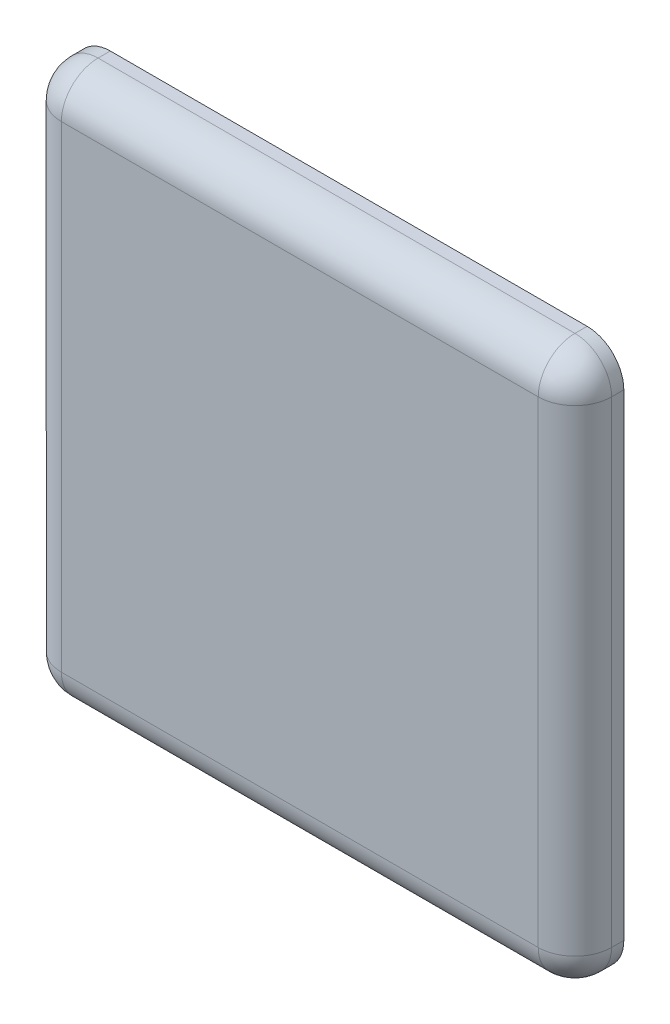
ISO-10303-21;
HEADER;
FILE_DESCRIPTION(('STEP AP214'),'2;1');
FILE_NAME('part.step','',(''),(''),'','','');
FILE_SCHEMA(('AUTOMOTIVE_DESIGN { 1 0 10303 214 1 1 1 1 }'));
ENDSEC;
DATA;
#1=APPLICATION_CONTEXT('core data for automotive mechanical design processes');
#2=APPLICATION_PROTOCOL_DEFINITION('international standard','automotive_design',2000,#1);
#3=PRODUCT_CONTEXT('',#1,'mechanical');
#4=PRODUCT('Part','Part','',(#3));
#5=PRODUCT_RELATED_PRODUCT_CATEGORY('part','',(#4));
#6=PRODUCT_DEFINITION_FORMATION('','',#4);
#7=PRODUCT_DEFINITION_CONTEXT('part definition',#1,'design');
#8=PRODUCT_DEFINITION('design','',#6,#7);
#9=PRODUCT_DEFINITION_SHAPE('','',#8);
#10=(LENGTH_UNIT() NAMED_UNIT(*) SI_UNIT(.MILLI.,.METRE.));
#11=(NAMED_UNIT(*) PLANE_ANGLE_UNIT() SI_UNIT($,.RADIAN.));
#12=(NAMED_UNIT(*) SI_UNIT($,.STERADIAN.) SOLID_ANGLE_UNIT());
#13=UNCERTAINTY_MEASURE_WITH_UNIT(LENGTH_MEASURE(1.E-05),#10,'distance_accuracy_value','');
#14=(GEOMETRIC_REPRESENTATION_CONTEXT(3) GLOBAL_UNCERTAINTY_ASSIGNED_CONTEXT((#13)) GLOBAL_UNIT_ASSIGNED_CONTEXT((#10,
#11,#12)) REPRESENTATION_CONTEXT('',''));
#15=CARTESIAN_POINT('',(0.,0.,0.));
#16=DIRECTION('',(0.,0.,1.));
#17=DIRECTION('',(1.,0.,0.));
#18=AXIS2_PLACEMENT_3D('',#15,#16,#17);
#19=CARTESIAN_POINT('',(0.,0.,4.));
#20=DIRECTION('',(0.,0.,1.));
#21=DIRECTION('',(1.,0.,0.));
#22=AXIS2_PLACEMENT_3D('',#19,#20,#21);
#23=PLANE('',#22);
#24=DIRECTION('',(1.,0.,0.));
#25=VECTOR('',#24,1.);
#26=CARTESIAN_POINT('',(-39.08016580655,-19.5,4.));
#27=LINE('',#26,#25);
#28=CARTESIAN_POINT('',(19.5,-19.5,4.));
#29=VERTEX_POINT('',#28);
#30=CARTESIAN_POINT('',(-19.5,-19.5,4.));
#31=VERTEX_POINT('',#30);
#32=EDGE_CURVE('E72',#29,#31,#27,.F.);
#33=ORIENTED_EDGE('',*,*,#32,.F.);
#34=DIRECTION('',(0.,1.,0.));
#35=VECTOR('',#34,1.);
#36=CARTESIAN_POINT('',(19.5,-39.08016580655,4.));
#37=LINE('',#36,#35);
#38=CARTESIAN_POINT('',(19.5,19.5,4.));
#39=VERTEX_POINT('',#38);
#40=EDGE_CURVE('E68',#39,#29,#37,.F.);
#41=ORIENTED_EDGE('',*,*,#40,.F.);
#42=DIRECTION('',(-1.,0.,0.));
#43=VECTOR('',#42,1.);
#44=CARTESIAN_POINT('',(39.08016580655,19.5,4.));
#45=LINE('',#44,#43);
#46=CARTESIAN_POINT('',(-19.5,19.5,4.));
#47=VERTEX_POINT('',#46);
#48=EDGE_CURVE('E56',#47,#39,#45,.F.);
#49=ORIENTED_EDGE('',*,*,#48,.F.);
#50=DIRECTION('',(0.,-1.,0.));
#51=VECTOR('',#50,1.);
#52=CARTESIAN_POINT('',(-19.5,39.08016580655,4.));
#53=LINE('',#52,#51);
#54=EDGE_CURVE('E144',#31,#47,#53,.F.);
#55=ORIENTED_EDGE('',*,*,#54,.F.);
#56=EDGE_LOOP('',(#33,#41,#49,#55));
#57=FACE_BOUND('',#56,.T.);
#58=ADVANCED_FACE('F15',(#57),#23,.T.);
#59=CARTESIAN_POINT('',(19.5,19.5,1.));
#60=DIRECTION('',(0.707106781186548,0.,0.707106781186548));
#61=DIRECTION('',(0.,1.,0.));
#62=AXIS2_PLACEMENT_3D('',#59,#60,#61);
#63=SPHERICAL_SURFACE('',#62,3.);
#64=CARTESIAN_POINT('',(19.5,19.5,1.));
#65=DIRECTION('',(0.,1.,0.));
#66=DIRECTION('',(0.,0.,1.));
#67=AXIS2_PLACEMENT_3D('',#64,#65,#66);
#68=CIRCLE('',#67,3.);
#69=CARTESIAN_POINT('',(22.5,19.5,1.));
#70=VERTEX_POINT('',#69);
#71=CARTESIAN_POINT('',(21.6213203435596,19.5,3.12132034355964));
#72=VERTEX_POINT('',#71);
#73=EDGE_CURVE('E85',#70,#72,#68,.F.);
#74=ORIENTED_EDGE('',*,*,#73,.F.);
#75=CARTESIAN_POINT('',(19.5,19.5,1.));
#76=DIRECTION('',(0.,0.,-1.));
#77=DIRECTION('',(-1.,0.,0.));
#78=AXIS2_PLACEMENT_3D('',#75,#76,#77);
#79=CIRCLE('',#78,3.);
#80=CARTESIAN_POINT('',(19.5,22.5,1.));
#81=VERTEX_POINT('',#80);
#82=EDGE_CURVE('E76',#81,#70,#79,.T.);
#83=ORIENTED_EDGE('',*,*,#82,.F.);
#84=CARTESIAN_POINT('',(19.5,19.5,1.));
#85=DIRECTION('',(-1.,0.,0.));
#86=DIRECTION('',(0.,0.,1.));
#87=AXIS2_PLACEMENT_3D('',#84,#85,#86);
#88=CIRCLE('',#87,3.);
#89=EDGE_CURVE('E19',#39,#81,#88,.T.);
#90=ORIENTED_EDGE('',*,*,#89,.F.);
#91=CARTESIAN_POINT('',(19.5,19.5,1.));
#92=DIRECTION('',(0.,1.,0.));
#93=DIRECTION('',(0.,0.,1.));
#94=AXIS2_PLACEMENT_3D('',#91,#92,#93);
#95=CIRCLE('',#94,3.);
#96=EDGE_CURVE('E77',#72,#39,#95,.F.);
#97=ORIENTED_EDGE('',*,*,#96,.F.);
#98=EDGE_LOOP('',(#74,#83,#90,#97));
#99=FACE_BOUND('',#98,.T.);
#100=ADVANCED_FACE('F88',(#99),#63,.T.);
#101=CARTESIAN_POINT('',(39.08016580655,19.5,1.));
#102=DIRECTION('',(-1.,0.,0.));
#103=DIRECTION('',(0.,0.,1.));
#104=AXIS2_PLACEMENT_3D('',#101,#102,#103);
#105=CYLINDRICAL_SURFACE('',#104,3.);
#106=CARTESIAN_POINT('',(-19.5,19.5,1.));
#107=DIRECTION('',(-1.,0.,0.));
#108=DIRECTION('',(0.,0.,1.));
#109=AXIS2_PLACEMENT_3D('',#106,#107,#108);
#110=CIRCLE('',#109,3.);
#111=CARTESIAN_POINT('',(-19.5,22.5,1.));
#112=VERTEX_POINT('',#111);
#113=EDGE_CURVE('E62',#47,#112,#110,.T.);
#114=ORIENTED_EDGE('',*,*,#113,.F.);
#115=ORIENTED_EDGE('',*,*,#48,.T.);
#116=ORIENTED_EDGE('',*,*,#89,.T.);
#117=DIRECTION('',(1.,0.,0.));
#118=VECTOR('',#117,1.);
#119=CARTESIAN_POINT('',(22.5,22.5,1.));
#120=LINE('',#119,#118);
#121=EDGE_CURVE('E101',#112,#81,#120,.T.);
#122=ORIENTED_EDGE('',*,*,#121,.F.);
#123=EDGE_LOOP('',(#114,#115,#116,#122));
#124=FACE_BOUND('',#123,.T.);
#125=ADVANCED_FACE('F58',(#124),#105,.T.);
#126=CARTESIAN_POINT('',(-19.5,19.5,1.));
#127=DIRECTION('',(-0.707106781186548,0.,0.707106781186548));
#128=DIRECTION('',(0.,1.,0.));
#129=AXIS2_PLACEMENT_3D('',#126,#127,#128);
#130=SPHERICAL_SURFACE('',#129,3.);
#131=ORIENTED_EDGE('',*,*,#113,.T.);
#132=CARTESIAN_POINT('',(-19.5,19.5,1.));
#133=DIRECTION('',(0.,0.,-1.));
#134=DIRECTION('',(-1.,0.,0.));
#135=AXIS2_PLACEMENT_3D('',#132,#133,#134);
#136=CIRCLE('',#135,3.);
#137=CARTESIAN_POINT('',(-22.5,19.5,1.));
#138=VERTEX_POINT('',#137);
#139=EDGE_CURVE('E108',#138,#112,#136,.T.);
#140=ORIENTED_EDGE('',*,*,#139,.F.);
#141=CARTESIAN_POINT('',(-19.5,19.5,1.));
#142=DIRECTION('',(0.,-1.,0.));
#143=DIRECTION('',(0.,0.,-1.));
#144=AXIS2_PLACEMENT_3D('',#141,#142,#143);
#145=CIRCLE('',#144,3.);
#146=CARTESIAN_POINT('',(-21.6213203435596,19.5,3.12132034355964));
#147=VERTEX_POINT('',#146);
#148=EDGE_CURVE('E141',#147,#138,#145,.T.);
#149=ORIENTED_EDGE('',*,*,#148,.F.);
#150=CARTESIAN_POINT('',(-19.5,19.5,1.));
#151=DIRECTION('',(0.,-1.,0.));
#152=DIRECTION('',(0.,0.,-1.));
#153=AXIS2_PLACEMENT_3D('',#150,#151,#152);
#154=CIRCLE('',#153,3.);
#155=EDGE_CURVE('E34',#47,#147,#154,.T.);
#156=ORIENTED_EDGE('',*,*,#155,.F.);
#157=EDGE_LOOP('',(#131,#140,#149,#156));
#158=FACE_BOUND('',#157,.T.);
#159=ADVANCED_FACE('F176',(#158),#130,.T.);
#160=CARTESIAN_POINT('',(-19.5,39.08016580655,1.));
#161=DIRECTION('',(0.,-1.,0.));
#162=DIRECTION('',(0.,0.,-1.));
#163=AXIS2_PLACEMENT_3D('',#160,#161,#162);
#164=CYLINDRICAL_SURFACE('',#163,3.);
#165=CARTESIAN_POINT('',(-19.5,-19.5,1.));
#166=DIRECTION('',(0.,-1.,0.));
#167=DIRECTION('',(0.,0.,-1.));
#168=AXIS2_PLACEMENT_3D('',#165,#166,#167);
#169=CIRCLE('',#168,3.);
#170=CARTESIAN_POINT('',(-22.5,-19.5,1.));
#171=VERTEX_POINT('',#170);
#172=EDGE_CURVE('E135',#31,#171,#169,.T.);
#173=ORIENTED_EDGE('',*,*,#172,.F.);
#174=ORIENTED_EDGE('',*,*,#54,.T.);
#175=ORIENTED_EDGE('',*,*,#155,.T.);
#176=ORIENTED_EDGE('',*,*,#148,.T.);
#177=DIRECTION('',(0.,1.,0.));
#178=VECTOR('',#177,1.);
#179=CARTESIAN_POINT('',(-22.5,22.5,1.));
#180=LINE('',#179,#178);
#181=EDGE_CURVE('E136',#171,#138,#180,.T.);
#182=ORIENTED_EDGE('',*,*,#181,.F.);
#183=EDGE_LOOP('',(#173,#174,#175,#176,#182));
#184=FACE_BOUND('',#183,.T.);
#185=ADVANCED_FACE('F286',(#184),#164,.T.);
#186=CARTESIAN_POINT('',(-19.5,-19.5,1.));
#187=DIRECTION('',(0.,-0.707106781186548,0.707106781186548));
#188=DIRECTION('',(-1.,0.,0.));
#189=AXIS2_PLACEMENT_3D('',#186,#187,#188);
#190=SPHERICAL_SURFACE('',#189,3.);
#191=ORIENTED_EDGE('',*,*,#172,.T.);
#192=CARTESIAN_POINT('',(-19.5,-19.5,1.));
#193=DIRECTION('',(0.,0.,-1.));
#194=DIRECTION('',(-1.,0.,0.));
#195=AXIS2_PLACEMENT_3D('',#192,#193,#194);
#196=CIRCLE('',#195,3.);
#197=CARTESIAN_POINT('',(-19.5,-22.5,1.));
#198=VERTEX_POINT('',#197);
#199=EDGE_CURVE('E139',#198,#171,#196,.T.);
#200=ORIENTED_EDGE('',*,*,#199,.F.);
#201=CARTESIAN_POINT('',(-19.5,-19.5,1.));
#202=DIRECTION('',(1.,0.,0.));
#203=DIRECTION('',(0.,0.,-1.));
#204=AXIS2_PLACEMENT_3D('',#201,#202,#203);
#205=CIRCLE('',#204,3.);
#206=CARTESIAN_POINT('',(-19.5,-21.6213203435596,3.12132034355964));
#207=VERTEX_POINT('',#206);
#208=EDGE_CURVE('E134',#207,#198,#205,.T.);
#209=ORIENTED_EDGE('',*,*,#208,.F.);
#210=CARTESIAN_POINT('',(-19.5,-19.5,1.));
#211=DIRECTION('',(1.,0.,0.));
#212=DIRECTION('',(0.,0.,-1.));
#213=AXIS2_PLACEMENT_3D('',#210,#211,#212);
#214=CIRCLE('',#213,3.);
#215=EDGE_CURVE('E132',#31,#207,#214,.T.);
#216=ORIENTED_EDGE('',*,*,#215,.F.);
#217=EDGE_LOOP('',(#191,#200,#209,#216));
#218=FACE_BOUND('',#217,.T.);
#219=ADVANCED_FACE('F287',(#218),#190,.T.);
#220=CARTESIAN_POINT('',(-39.08016580655,-19.5,1.));
#221=DIRECTION('',(1.,0.,0.));
#222=DIRECTION('',(0.,0.,-1.));
#223=AXIS2_PLACEMENT_3D('',#220,#221,#222);
#224=CYLINDRICAL_SURFACE('',#223,3.);
#225=CARTESIAN_POINT('',(19.5,-19.5,1.));
#226=DIRECTION('',(1.,0.,0.));
#227=DIRECTION('',(0.,0.,-1.));
#228=AXIS2_PLACEMENT_3D('',#225,#226,#227);
#229=CIRCLE('',#228,3.);
#230=CARTESIAN_POINT('',(19.5,-22.5,1.));
#231=VERTEX_POINT('',#230);
#232=EDGE_CURVE('E126',#29,#231,#229,.T.);
#233=ORIENTED_EDGE('',*,*,#232,.F.);
#234=ORIENTED_EDGE('',*,*,#32,.T.);
#235=ORIENTED_EDGE('',*,*,#215,.T.);
#236=ORIENTED_EDGE('',*,*,#208,.T.);
#237=DIRECTION('',(1.,0.,0.));
#238=VECTOR('',#237,1.);
#239=CARTESIAN_POINT('',(-22.5,-22.5,1.));
#240=LINE('',#239,#238);
#241=EDGE_CURVE('E127',#231,#198,#240,.F.);
#242=ORIENTED_EDGE('',*,*,#241,.F.);
#243=EDGE_LOOP('',(#233,#234,#235,#236,#242));
#244=FACE_BOUND('',#243,.T.);
#245=ADVANCED_FACE('F211',(#244),#224,.T.);
#246=CARTESIAN_POINT('',(19.5,-19.5,1.));
#247=DIRECTION('',(0.707106781186548,0.,0.707106781186548));
#248=DIRECTION('',(0.,-1.,0.));
#249=AXIS2_PLACEMENT_3D('',#246,#247,#248);
#250=SPHERICAL_SURFACE('',#249,3.);
#251=ORIENTED_EDGE('',*,*,#232,.T.);
#252=CARTESIAN_POINT('',(19.5,-19.5,1.));
#253=DIRECTION('',(0.,0.,-1.));
#254=DIRECTION('',(-1.,0.,0.));
#255=AXIS2_PLACEMENT_3D('',#252,#253,#254);
#256=CIRCLE('',#255,3.);
#257=CARTESIAN_POINT('',(22.5,-19.5,1.));
#258=VERTEX_POINT('',#257);
#259=EDGE_CURVE('E130',#258,#231,#256,.T.);
#260=ORIENTED_EDGE('',*,*,#259,.F.);
#261=CARTESIAN_POINT('',(19.5,-19.5,1.));
#262=DIRECTION('',(0.,1.,0.));
#263=DIRECTION('',(0.,0.,1.));
#264=AXIS2_PLACEMENT_3D('',#261,#262,#263);
#265=CIRCLE('',#264,3.);
#266=CARTESIAN_POINT('',(21.6213203435596,-19.5,3.12132034355964));
#267=VERTEX_POINT('',#266);
#268=EDGE_CURVE('E119',#267,#258,#265,.T.);
#269=ORIENTED_EDGE('',*,*,#268,.F.);
#270=CARTESIAN_POINT('',(19.5,-19.5,1.));
#271=DIRECTION('',(0.,1.,0.));
#272=DIRECTION('',(0.,0.,1.));
#273=AXIS2_PLACEMENT_3D('',#270,#271,#272);
#274=CIRCLE('',#273,3.);
#275=EDGE_CURVE('E124',#29,#267,#274,.T.);
#276=ORIENTED_EDGE('',*,*,#275,.F.);
#277=EDGE_LOOP('',(#251,#260,#269,#276));
#278=FACE_BOUND('',#277,.T.);
#279=ADVANCED_FACE('F207',(#278),#250,.T.);
#280=CARTESIAN_POINT('',(19.5,-39.08016580655,1.));
#281=DIRECTION('',(0.,1.,0.));
#282=DIRECTION('',(0.,0.,1.));
#283=AXIS2_PLACEMENT_3D('',#280,#281,#282);
#284=CYLINDRICAL_SURFACE('',#283,3.);
#285=ORIENTED_EDGE('',*,*,#96,.T.);
#286=ORIENTED_EDGE('',*,*,#40,.T.);
#287=ORIENTED_EDGE('',*,*,#275,.T.);
#288=ORIENTED_EDGE('',*,*,#268,.T.);
#289=DIRECTION('',(0.,1.,0.));
#290=VECTOR('',#289,1.);
#291=CARTESIAN_POINT('',(22.5,-22.5,1.));
#292=LINE('',#291,#290);
#293=EDGE_CURVE('E120',#70,#258,#292,.F.);
#294=ORIENTED_EDGE('',*,*,#293,.F.);
#295=ORIENTED_EDGE('',*,*,#73,.T.);
#296=EDGE_LOOP('',(#285,#286,#287,#288,#294,#295));
#297=FACE_BOUND('',#296,.T.);
#298=ADVANCED_FACE('F81',(#297),#284,.T.);
#299=CARTESIAN_POINT('',(19.5,19.5,4.109537206765));
#300=DIRECTION('',(0.,0.,-1.));
#301=DIRECTION('',(-1.,0.,0.));
#302=AXIS2_PLACEMENT_3D('',#299,#300,#301);
#303=CYLINDRICAL_SURFACE('',#302,3.);
#304=CARTESIAN_POINT('',(19.5,19.5,0.));
#305=DIRECTION('',(0.,0.,-1.));
#306=DIRECTION('',(-1.,0.,0.));
#307=AXIS2_PLACEMENT_3D('',#304,#305,#306);
#308=CIRCLE('',#307,3.);
#309=CARTESIAN_POINT('',(22.5,19.5,0.));
#310=VERTEX_POINT('',#309);
#311=CARTESIAN_POINT('',(19.5,22.5,0.));
#312=VERTEX_POINT('',#311);
#313=EDGE_CURVE('E113',#310,#312,#308,.F.);
#314=ORIENTED_EDGE('',*,*,#313,.T.);
#315=DIRECTION('',(0.,0.,1.));
#316=VECTOR('',#315,1.);
#317=CARTESIAN_POINT('',(19.5,22.5,0.));
#318=LINE('',#317,#316);
#319=EDGE_CURVE('E96',#81,#312,#318,.F.);
#320=ORIENTED_EDGE('',*,*,#319,.F.);
#321=ORIENTED_EDGE('',*,*,#82,.T.);
#322=DIRECTION('',(0.,0.,-1.));
#323=VECTOR('',#322,1.);
#324=CARTESIAN_POINT('',(22.5,19.5,0.));
#325=LINE('',#324,#323);
#326=EDGE_CURVE('E123',#310,#70,#325,.F.);
#327=ORIENTED_EDGE('',*,*,#326,.F.);
#328=EDGE_LOOP('',(#314,#320,#321,#327));
#329=FACE_BOUND('',#328,.T.);
#330=ADVANCED_FACE('F111',(#329),#303,.T.);
#331=CARTESIAN_POINT('',(22.5,22.5,0.));
#332=DIRECTION('',(0.,1.,0.));
#333=DIRECTION('',(0.,0.,1.));
#334=AXIS2_PLACEMENT_3D('',#331,#332,#333);
#335=PLANE('',#334);
#336=DIRECTION('',(0.,0.,-1.));
#337=VECTOR('',#336,1.);
#338=CARTESIAN_POINT('',(-19.5,22.5,4.109537206765));
#339=LINE('',#338,#337);
#340=CARTESIAN_POINT('',(-19.5,22.5,0.));
#341=VERTEX_POINT('',#340);
#342=EDGE_CURVE('E107',#112,#341,#339,.T.);
#343=ORIENTED_EDGE('',*,*,#342,.F.);
#344=ORIENTED_EDGE('',*,*,#121,.T.);
#345=ORIENTED_EDGE('',*,*,#319,.T.);
#346=DIRECTION('',(1.,0.,0.));
#347=VECTOR('',#346,1.);
#348=CARTESIAN_POINT('',(0.,22.5,0.));
#349=LINE('',#348,#347);
#350=EDGE_CURVE('E156',#312,#341,#349,.F.);
#351=ORIENTED_EDGE('',*,*,#350,.T.);
#352=EDGE_LOOP('',(#343,#344,#345,#351));
#353=FACE_BOUND('',#352,.T.);
#354=ADVANCED_FACE('F102',(#353),#335,.T.);
#355=CARTESIAN_POINT('',(-19.5,19.5,4.109537206765));
#356=DIRECTION('',(0.,0.,-1.));
#357=DIRECTION('',(-1.,0.,0.));
#358=AXIS2_PLACEMENT_3D('',#355,#356,#357);
#359=CYLINDRICAL_SURFACE('',#358,3.);
#360=CARTESIAN_POINT('',(-19.5,19.5,0.));
#361=DIRECTION('',(0.,0.,-1.));
#362=DIRECTION('',(-1.,0.,0.));
#363=AXIS2_PLACEMENT_3D('',#360,#361,#362);
#364=CIRCLE('',#363,3.);
#365=CARTESIAN_POINT('',(-22.5,19.5,0.));
#366=VERTEX_POINT('',#365);
#367=EDGE_CURVE('E153',#341,#366,#364,.F.);
#368=ORIENTED_EDGE('',*,*,#367,.T.);
#369=DIRECTION('',(0.,0.,1.));
#370=VECTOR('',#369,1.);
#371=CARTESIAN_POINT('',(-22.5,19.5,0.));
#372=LINE('',#371,#370);
#373=EDGE_CURVE('E140',#138,#366,#372,.F.);
#374=ORIENTED_EDGE('',*,*,#373,.F.);
#375=ORIENTED_EDGE('',*,*,#139,.T.);
#376=ORIENTED_EDGE('',*,*,#342,.T.);
#377=EDGE_LOOP('',(#368,#374,#375,#376));
#378=FACE_BOUND('',#377,.T.);
#379=ADVANCED_FACE('F179',(#378),#359,.T.);
#380=CARTESIAN_POINT('',(-22.5,22.5,0.));
#381=DIRECTION('',(-1.,0.,0.));
#382=DIRECTION('',(0.,0.,1.));
#383=AXIS2_PLACEMENT_3D('',#380,#381,#382);
#384=PLANE('',#383);
#385=DIRECTION('',(0.,0.,-1.));
#386=VECTOR('',#385,1.);
#387=CARTESIAN_POINT('',(-22.5,-19.5,4.109537206765));
#388=LINE('',#387,#386);
#389=CARTESIAN_POINT('',(-22.5,-19.5,0.));
#390=VERTEX_POINT('',#389);
#391=EDGE_CURVE('E163',#171,#390,#388,.T.);
#392=ORIENTED_EDGE('',*,*,#391,.F.);
#393=ORIENTED_EDGE('',*,*,#181,.T.);
#394=ORIENTED_EDGE('',*,*,#373,.T.);
#395=DIRECTION('',(0.,1.,0.));
#396=VECTOR('',#395,1.);
#397=CARTESIAN_POINT('',(-22.5,0.,0.));
#398=LINE('',#397,#396);
#399=EDGE_CURVE('E152',#366,#390,#398,.F.);
#400=ORIENTED_EDGE('',*,*,#399,.T.);
#401=EDGE_LOOP('',(#392,#393,#394,#400));
#402=FACE_BOUND('',#401,.T.);
#403=ADVANCED_FACE('F222',(#402),#384,.T.);
#404=CARTESIAN_POINT('',(-19.5,-19.5,4.109537206765));
#405=DIRECTION('',(0.,0.,-1.));
#406=DIRECTION('',(-1.,0.,0.));
#407=AXIS2_PLACEMENT_3D('',#404,#405,#406);
#408=CYLINDRICAL_SURFACE('',#407,3.);
#409=CARTESIAN_POINT('',(-19.5,-19.5,0.));
#410=DIRECTION('',(0.,0.,-1.));
#411=DIRECTION('',(-1.,0.,0.));
#412=AXIS2_PLACEMENT_3D('',#409,#410,#411);
#413=CIRCLE('',#412,3.);
#414=CARTESIAN_POINT('',(-19.5,-22.5,0.));
#415=VERTEX_POINT('',#414);
#416=EDGE_CURVE('E149',#390,#415,#413,.F.);
#417=ORIENTED_EDGE('',*,*,#416,.T.);
#418=DIRECTION('',(0.,0.,-1.));
#419=VECTOR('',#418,1.);
#420=CARTESIAN_POINT('',(-19.5,-22.5,0.));
#421=LINE('',#420,#419);
#422=EDGE_CURVE('E131',#198,#415,#421,.T.);
#423=ORIENTED_EDGE('',*,*,#422,.F.);
#424=ORIENTED_EDGE('',*,*,#199,.T.);
#425=ORIENTED_EDGE('',*,*,#391,.T.);
#426=EDGE_LOOP('',(#417,#423,#424,#425));
#427=FACE_BOUND('',#426,.T.);
#428=ADVANCED_FACE('F225',(#427),#408,.T.);
#429=CARTESIAN_POINT('',(-22.5,-22.5,0.));
#430=DIRECTION('',(0.,-1.,0.));
#431=DIRECTION('',(0.,0.,-1.));
#432=AXIS2_PLACEMENT_3D('',#429,#430,#431);
#433=PLANE('',#432);
#434=DIRECTION('',(0.,0.,-1.));
#435=VECTOR('',#434,1.);
#436=CARTESIAN_POINT('',(19.5,-22.5,4.109537206765));
#437=LINE('',#436,#435);
#438=CARTESIAN_POINT('',(19.5,-22.5,0.));
#439=VERTEX_POINT('',#438);
#440=EDGE_CURVE('E160',#231,#439,#437,.T.);
#441=ORIENTED_EDGE('',*,*,#440,.F.);
#442=ORIENTED_EDGE('',*,*,#241,.T.);
#443=ORIENTED_EDGE('',*,*,#422,.T.);
#444=DIRECTION('',(1.,0.,0.));
#445=VECTOR('',#444,1.);
#446=CARTESIAN_POINT('',(0.,-22.5,0.));
#447=LINE('',#446,#445);
#448=EDGE_CURVE('E148',#415,#439,#447,.T.);
#449=ORIENTED_EDGE('',*,*,#448,.T.);
#450=EDGE_LOOP('',(#441,#442,#443,#449));
#451=FACE_BOUND('',#450,.T.);
#452=ADVANCED_FACE('F228',(#451),#433,.T.);
#453=CARTESIAN_POINT('',(19.5,-19.5,4.109537206765));
#454=DIRECTION('',(0.,0.,-1.));
#455=DIRECTION('',(-1.,0.,0.));
#456=AXIS2_PLACEMENT_3D('',#453,#454,#455);
#457=CYLINDRICAL_SURFACE('',#456,3.);
#458=CARTESIAN_POINT('',(19.5,-19.5,0.));
#459=DIRECTION('',(0.,0.,-1.));
#460=DIRECTION('',(-1.,0.,0.));
#461=AXIS2_PLACEMENT_3D('',#458,#459,#460);
#462=CIRCLE('',#461,3.);
#463=CARTESIAN_POINT('',(22.5,-19.5,0.));
#464=VERTEX_POINT('',#463);
#465=EDGE_CURVE('E25',#439,#464,#462,.F.);
#466=ORIENTED_EDGE('',*,*,#465,.T.);
#467=DIRECTION('',(0.,0.,-1.));
#468=VECTOR('',#467,1.);
#469=CARTESIAN_POINT('',(22.5,-19.5,0.));
#470=LINE('',#469,#468);
#471=EDGE_CURVE('E194',#258,#464,#470,.T.);
#472=ORIENTED_EDGE('',*,*,#471,.F.);
#473=ORIENTED_EDGE('',*,*,#259,.T.);
#474=ORIENTED_EDGE('',*,*,#440,.T.);
#475=EDGE_LOOP('',(#466,#472,#473,#474));
#476=FACE_BOUND('',#475,.T.);
#477=ADVANCED_FACE('F232',(#476),#457,.T.);
#478=CARTESIAN_POINT('',(22.5,-22.5,0.));
#479=DIRECTION('',(1.,0.,0.));
#480=DIRECTION('',(0.,0.,-1.));
#481=AXIS2_PLACEMENT_3D('',#478,#479,#480);
#482=PLANE('',#481);
#483=ORIENTED_EDGE('',*,*,#326,.T.);
#484=ORIENTED_EDGE('',*,*,#293,.T.);
#485=ORIENTED_EDGE('',*,*,#471,.T.);
#486=DIRECTION('',(0.,1.,0.));
#487=VECTOR('',#486,1.);
#488=CARTESIAN_POINT('',(22.5,0.,0.));
#489=LINE('',#488,#487);
#490=EDGE_CURVE('E10',#464,#310,#489,.T.);
#491=ORIENTED_EDGE('',*,*,#490,.T.);
#492=EDGE_LOOP('',(#483,#484,#485,#491));
#493=FACE_BOUND('',#492,.T.);
#494=ADVANCED_FACE('F235',(#493),#482,.T.);
#495=CARTESIAN_POINT('',(0.,0.,0.));
#496=DIRECTION('',(0.,0.,1.));
#497=DIRECTION('',(1.,0.,0.));
#498=AXIS2_PLACEMENT_3D('',#495,#496,#497);
#499=PLANE('',#498);
#500=ORIENTED_EDGE('',*,*,#465,.F.);
#501=ORIENTED_EDGE('',*,*,#448,.F.);
#502=ORIENTED_EDGE('',*,*,#416,.F.);
#503=ORIENTED_EDGE('',*,*,#399,.F.);
#504=ORIENTED_EDGE('',*,*,#367,.F.);
#505=ORIENTED_EDGE('',*,*,#350,.F.);
#506=ORIENTED_EDGE('',*,*,#313,.F.);
#507=ORIENTED_EDGE('',*,*,#490,.F.);
#508=EDGE_LOOP('',(#500,#501,#502,#503,#504,#505,#506,#507));
#509=FACE_BOUND('',#508,.T.);
#510=ADVANCED_FACE('F17',(#509),#499,.F.);
#511=CLOSED_SHELL('',(#58,#100,#125,#159,#185,#219,#245,#279,#298,#330,#354,#379,#403,#428,#452,
#477,#494,#510));
#512=MANIFOLD_SOLID_BREP('B1',#511);
#513=ADVANCED_BREP_SHAPE_REPRESENTATION('',(#18,#512),#14);
#514=SHAPE_DEFINITION_REPRESENTATION(#9,#513);
ENDSEC;
END-ISO-10303-21;
